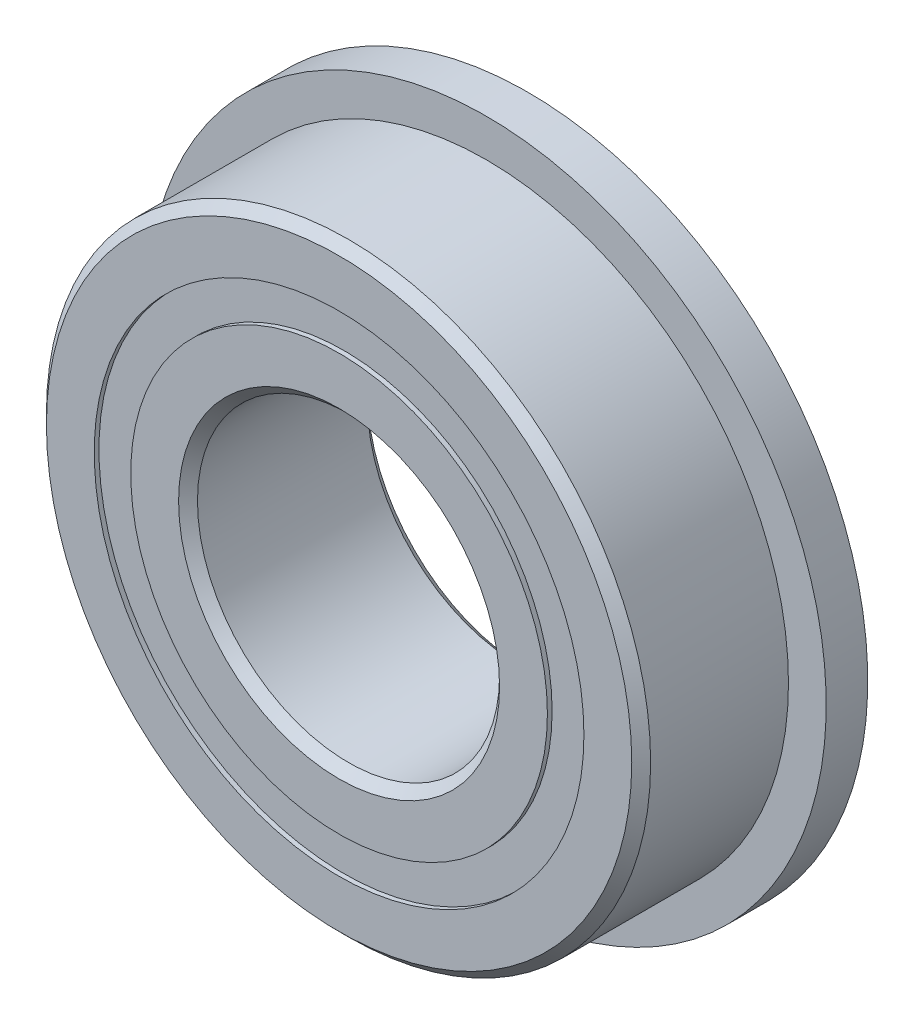
ISO-10303-21;
HEADER;
FILE_DESCRIPTION(('STEP AP214'),'2;1');
FILE_NAME('part.step','',(''),(''),'','','');
FILE_SCHEMA(('AUTOMOTIVE_DESIGN { 1 0 10303 214 1 1 1 1 }'));
ENDSEC;
DATA;
#1=APPLICATION_CONTEXT('core data for automotive mechanical design processes');
#2=APPLICATION_PROTOCOL_DEFINITION('international standard','automotive_design',2000,#1);
#3=PRODUCT_CONTEXT('',#1,'mechanical');
#4=PRODUCT('Part','Part','',(#3));
#5=PRODUCT_RELATED_PRODUCT_CATEGORY('part','',(#4));
#6=PRODUCT_DEFINITION_FORMATION('','',#4);
#7=PRODUCT_DEFINITION_CONTEXT('part definition',#1,'design');
#8=PRODUCT_DEFINITION('design','',#6,#7);
#9=PRODUCT_DEFINITION_SHAPE('','',#8);
#10=(LENGTH_UNIT() NAMED_UNIT(*) SI_UNIT(.MILLI.,.METRE.));
#11=(NAMED_UNIT(*) PLANE_ANGLE_UNIT() SI_UNIT($,.RADIAN.));
#12=(NAMED_UNIT(*) SI_UNIT($,.STERADIAN.) SOLID_ANGLE_UNIT());
#13=UNCERTAINTY_MEASURE_WITH_UNIT(LENGTH_MEASURE(1.E-05),#10,'distance_accuracy_value','');
#14=(GEOMETRIC_REPRESENTATION_CONTEXT(3) GLOBAL_UNCERTAINTY_ASSIGNED_CONTEXT((#13)) GLOBAL_UNIT_ASSIGNED_CONTEXT((#10,
#11,#12)) REPRESENTATION_CONTEXT('',''));
#15=CARTESIAN_POINT('',(0.,0.,0.));
#16=DIRECTION('',(0.,0.,1.));
#17=DIRECTION('',(1.,0.,0.));
#18=AXIS2_PLACEMENT_3D('',#15,#16,#17);
#19=CARTESIAN_POINT('',(0.,6.48351648351648,-2.375));
#20=DIRECTION('',(0.,0.,1.));
#21=DIRECTION('',(1.,0.,0.));
#22=AXIS2_PLACEMENT_3D('',#19,#20,#21);
#23=PLANE('',#22);
#24=CARTESIAN_POINT('',(0.,0.,-2.375));
#25=DIRECTION('',(0.,0.,1.));
#26=DIRECTION('',(1.,0.,0.));
#27=AXIS2_PLACEMENT_3D('',#24,#25,#26);
#28=CIRCLE('',#27,6.48351648351648);
#29=CARTESIAN_POINT('',(6.48351648351648,0.,-2.375));
#30=VERTEX_POINT('',#29);
#31=EDGE_CURVE('E60',#30,#30,#28,.T.);
#32=ORIENTED_EDGE('',*,*,#31,.F.);
#33=EDGE_LOOP('',(#32));
#34=FACE_BOUND('',#33,.T.);
#35=CARTESIAN_POINT('',(0.,0.,-2.375));
#36=DIRECTION('',(0.,0.,1.));
#37=DIRECTION('',(1.,0.,0.));
#38=AXIS2_PLACEMENT_3D('',#35,#36,#37);
#39=CIRCLE('',#38,5.51648351648352);
#40=CARTESIAN_POINT('',(5.51648351648352,0.,-2.375));
#41=VERTEX_POINT('',#40);
#42=EDGE_CURVE('E11',#41,#41,#39,.T.);
#43=ORIENTED_EDGE('',*,*,#42,.T.);
#44=EDGE_LOOP('',(#43));
#45=FACE_BOUND('',#44,.T.);
#46=ADVANCED_FACE('F46',(#34,#45),#23,.F.);
#47=CARTESIAN_POINT('',(0.,0.,2.5));
#48=DIRECTION('',(0.,0.,1.));
#49=DIRECTION('',(1.,0.,0.));
#50=AXIS2_PLACEMENT_3D('',#47,#48,#49);
#51=CYLINDRICAL_SURFACE('',#50,5.51648351648352);
#52=ORIENTED_EDGE('',*,*,#42,.F.);
#53=EDGE_LOOP('',(#52));
#54=FACE_BOUND('',#53,.T.);
#55=CARTESIAN_POINT('',(0.,0.,-1.21175743903915));
#56=DIRECTION('',(0.,0.,1.));
#57=DIRECTION('',(1.,0.,0.));
#58=AXIS2_PLACEMENT_3D('',#55,#56,#57);
#59=CIRCLE('',#58,5.51648351648352);
#60=CARTESIAN_POINT('',(5.51648351648352,0.,-1.21175743903915));
#61=VERTEX_POINT('',#60);
#62=EDGE_CURVE('E52',#61,#61,#59,.T.);
#63=ORIENTED_EDGE('',*,*,#62,.T.);
#64=EDGE_LOOP('',(#63));
#65=FACE_BOUND('',#64,.T.);
#66=ADVANCED_FACE('F69',(#54,#65),#51,.F.);
#67=CARTESIAN_POINT('',(0.,6.48351648351648,-1.21175743903915));
#68=DIRECTION('',(0.,0.,-1.));
#69=DIRECTION('',(-1.,0.,0.));
#70=AXIS2_PLACEMENT_3D('',#67,#68,#69);
#71=PLANE('',#70);
#72=ORIENTED_EDGE('',*,*,#62,.F.);
#73=EDGE_LOOP('',(#72));
#74=FACE_BOUND('',#73,.T.);
#75=CARTESIAN_POINT('',(0.,0.,-1.21175743903915));
#76=DIRECTION('',(0.,0.,1.));
#77=DIRECTION('',(1.,0.,0.));
#78=AXIS2_PLACEMENT_3D('',#75,#76,#77);
#79=CIRCLE('',#78,6.48351648351648);
#80=CARTESIAN_POINT('',(6.48351648351648,0.,-1.21175743903915));
#81=VERTEX_POINT('',#80);
#82=EDGE_CURVE('E56',#81,#81,#79,.T.);
#83=ORIENTED_EDGE('',*,*,#82,.T.);
#84=EDGE_LOOP('',(#83));
#85=FACE_BOUND('',#84,.T.);
#86=ADVANCED_FACE('F73',(#74,#85),#71,.F.);
#87=CARTESIAN_POINT('',(0.,0.,2.5));
#88=DIRECTION('',(0.,0.,1.));
#89=DIRECTION('',(1.,0.,0.));
#90=AXIS2_PLACEMENT_3D('',#87,#88,#89);
#91=CYLINDRICAL_SURFACE('',#90,6.48351648351648);
#92=ORIENTED_EDGE('',*,*,#82,.F.);
#93=EDGE_LOOP('',(#92));
#94=FACE_BOUND('',#93,.T.);
#95=ORIENTED_EDGE('',*,*,#31,.T.);
#96=EDGE_LOOP('',(#95));
#97=FACE_BOUND('',#96,.T.);
#98=ADVANCED_FACE('F66',(#94,#97),#91,.T.);
#99=CLOSED_SHELL('',(#46,#66,#86,#98));
#100=MANIFOLD_SOLID_BREP('B2',#99);
#101=CARTESIAN_POINT('',(0.,6.48351648351648,2.375));
#102=DIRECTION('',(0.,0.,-1.));
#103=DIRECTION('',(-1.,0.,0.));
#104=AXIS2_PLACEMENT_3D('',#101,#102,#103);
#105=PLANE('',#104);
#106=CARTESIAN_POINT('',(0.,0.,2.375));
#107=DIRECTION('',(0.,0.,1.));
#108=DIRECTION('',(1.,0.,0.));
#109=AXIS2_PLACEMENT_3D('',#106,#107,#108);
#110=CIRCLE('',#109,5.51648351648352);
#111=CARTESIAN_POINT('',(5.51648351648352,0.,2.375));
#112=VERTEX_POINT('',#111);
#113=EDGE_CURVE('E45',#112,#112,#110,.T.);
#114=ORIENTED_EDGE('',*,*,#113,.F.);
#115=EDGE_LOOP('',(#114));
#116=FACE_BOUND('',#115,.T.);
#117=CARTESIAN_POINT('',(0.,0.,2.375));
#118=DIRECTION('',(0.,0.,1.));
#119=DIRECTION('',(1.,0.,0.));
#120=AXIS2_PLACEMENT_3D('',#117,#118,#119);
#121=CIRCLE('',#120,6.48351648351648);
#122=CARTESIAN_POINT('',(6.48351648351648,0.,2.375));
#123=VERTEX_POINT('',#122);
#124=EDGE_CURVE('E128',#123,#123,#121,.T.);
#125=ORIENTED_EDGE('',*,*,#124,.T.);
#126=EDGE_LOOP('',(#125));
#127=FACE_BOUND('',#126,.T.);
#128=ADVANCED_FACE('F114',(#116,#127),#105,.F.);
#129=CARTESIAN_POINT('',(0.,0.,2.5));
#130=DIRECTION('',(0.,0.,1.));
#131=DIRECTION('',(1.,0.,0.));
#132=AXIS2_PLACEMENT_3D('',#129,#130,#131);
#133=CYLINDRICAL_SURFACE('',#132,5.51648351648352);
#134=CARTESIAN_POINT('',(0.,0.,1.21175743903915));
#135=DIRECTION('',(0.,0.,1.));
#136=DIRECTION('',(1.,0.,0.));
#137=AXIS2_PLACEMENT_3D('',#134,#135,#136);
#138=CIRCLE('',#137,5.51648351648352);
#139=CARTESIAN_POINT('',(5.51648351648352,0.,1.21175743903915));
#140=VERTEX_POINT('',#139);
#141=EDGE_CURVE('E120',#140,#140,#138,.T.);
#142=ORIENTED_EDGE('',*,*,#141,.F.);
#143=EDGE_LOOP('',(#142));
#144=FACE_BOUND('',#143,.T.);
#145=ORIENTED_EDGE('',*,*,#113,.T.);
#146=EDGE_LOOP('',(#145));
#147=FACE_BOUND('',#146,.T.);
#148=ADVANCED_FACE('F143',(#144,#147),#133,.F.);
#149=CARTESIAN_POINT('',(0.,6.48351648351648,1.21175743903915));
#150=DIRECTION('',(0.,0.,1.));
#151=DIRECTION('',(1.,0.,0.));
#152=AXIS2_PLACEMENT_3D('',#149,#150,#151);
#153=PLANE('',#152);
#154=CARTESIAN_POINT('',(0.,0.,1.21175743903915));
#155=DIRECTION('',(0.,0.,1.));
#156=DIRECTION('',(1.,0.,0.));
#157=AXIS2_PLACEMENT_3D('',#154,#155,#156);
#158=CIRCLE('',#157,6.48351648351648);
#159=CARTESIAN_POINT('',(6.48351648351648,0.,1.21175743903915));
#160=VERTEX_POINT('',#159);
#161=EDGE_CURVE('E124',#160,#160,#158,.T.);
#162=ORIENTED_EDGE('',*,*,#161,.F.);
#163=EDGE_LOOP('',(#162));
#164=FACE_BOUND('',#163,.T.);
#165=ORIENTED_EDGE('',*,*,#141,.T.);
#166=EDGE_LOOP('',(#165));
#167=FACE_BOUND('',#166,.T.);
#168=ADVANCED_FACE('F138',(#164,#167),#153,.F.);
#169=CARTESIAN_POINT('',(0.,0.,2.5));
#170=DIRECTION('',(0.,0.,1.));
#171=DIRECTION('',(1.,0.,0.));
#172=AXIS2_PLACEMENT_3D('',#169,#170,#171);
#173=CYLINDRICAL_SURFACE('',#172,6.48351648351648);
#174=ORIENTED_EDGE('',*,*,#124,.F.);
#175=EDGE_LOOP('',(#174));
#176=FACE_BOUND('',#175,.T.);
#177=ORIENTED_EDGE('',*,*,#161,.T.);
#178=EDGE_LOOP('',(#177));
#179=FACE_BOUND('',#178,.T.);
#180=ADVANCED_FACE('F135',(#176,#179),#173,.T.);
#181=CLOSED_SHELL('',(#128,#148,#168,#180));
#182=MANIFOLD_SOLID_BREP('B6',#181);
#183=CARTESIAN_POINT('',(-2.99999999999993,5.19615242270667,0.));
#184=DIRECTION('',(0.,0.,1.));
#185=DIRECTION('',(-0.499999999999989,0.866025403784445,0.));
#186=AXIS2_PLACEMENT_3D('',#183,#184,#185);
#187=SPHERICAL_SURFACE('',#186,1.21175743903915);
#188=CARTESIAN_POINT('',(-2.99999999999993,5.19615242270667,1.21175743903915));
#189=VERTEX_POINT('',#188);
#190=VERTEX_LOOP('',#189);
#191=FACE_BOUND('',#190,.T.);
#192=ADVANCED_FACE('F182',(#191),#187,.T.);
#193=CLOSED_SHELL('',(#192));
#194=MANIFOLD_SOLID_BREP('B40',#193);
#195=CARTESIAN_POINT('',(-5.1961524227066,3.00000000000006,0.));
#196=DIRECTION('',(0.,0.,1.));
#197=DIRECTION('',(-0.866025403784433,0.50000000000001,0.));
#198=AXIS2_PLACEMENT_3D('',#195,#196,#197);
#199=SPHERICAL_SURFACE('',#198,1.21175743903915);
#200=CARTESIAN_POINT('',(-5.1961524227066,3.00000000000006,1.21175743903915));
#201=VERTEX_POINT('',#200);
#202=VERTEX_LOOP('',#201);
#203=FACE_BOUND('',#202,.T.);
#204=ADVANCED_FACE('F203',(#203),#199,.T.);
#205=CLOSED_SHELL('',(#204));
#206=MANIFOLD_SOLID_BREP('B110',#205);
#207=CARTESIAN_POINT('',(-6.,0.,0.));
#208=DIRECTION('',(0.,0.,1.));
#209=DIRECTION('',(-1.,0.,0.));
#210=AXIS2_PLACEMENT_3D('',#207,#208,#209);
#211=SPHERICAL_SURFACE('',#210,1.21175743903915);
#212=CARTESIAN_POINT('',(-6.,0.,1.21175743903915));
#213=VERTEX_POINT('',#212);
#214=VERTEX_LOOP('',#213);
#215=FACE_BOUND('',#214,.T.);
#216=ADVANCED_FACE('F224',(#215),#211,.T.);
#217=CLOSED_SHELL('',(#216));
#218=MANIFOLD_SOLID_BREP('B178',#217);
#219=CARTESIAN_POINT('',(-5.19615242270666,-2.99999999999995,0.));
#220=DIRECTION('',(0.,0.,1.));
#221=DIRECTION('',(-0.866025403784443,-0.499999999999992,0.));
#222=AXIS2_PLACEMENT_3D('',#219,#220,#221);
#223=SPHERICAL_SURFACE('',#222,1.21175743903915);
#224=CARTESIAN_POINT('',(-5.19615242270666,-2.99999999999995,1.21175743903915));
#225=VERTEX_POINT('',#224);
#226=VERTEX_LOOP('',#225);
#227=FACE_BOUND('',#226,.T.);
#228=ADVANCED_FACE('F245',(#227),#223,.T.);
#229=CLOSED_SHELL('',(#228));
#230=MANIFOLD_SOLID_BREP('B199',#229);
#231=CARTESIAN_POINT('',(-3.00000000000004,-5.19615242270661,0.));
#232=DIRECTION('',(0.,0.,1.));
#233=DIRECTION('',(-0.500000000000007,-0.866025403784435,0.));
#234=AXIS2_PLACEMENT_3D('',#231,#232,#233);
#235=SPHERICAL_SURFACE('',#234,1.21175743903915);
#236=CARTESIAN_POINT('',(-3.00000000000004,-5.19615242270661,1.21175743903915));
#237=VERTEX_POINT('',#236);
#238=VERTEX_LOOP('',#237);
#239=FACE_BOUND('',#238,.T.);
#240=ADVANCED_FACE('F266',(#239),#235,.T.);
#241=CLOSED_SHELL('',(#240));
#242=MANIFOLD_SOLID_BREP('B220',#241);
#243=CARTESIAN_POINT('',(0.,-6.,0.));
#244=DIRECTION('',(0.,0.,1.));
#245=DIRECTION('',(0.,-1.,0.));
#246=AXIS2_PLACEMENT_3D('',#243,#244,#245);
#247=SPHERICAL_SURFACE('',#246,1.21175743903915);
#248=CARTESIAN_POINT('',(0.,-6.,1.21175743903915));
#249=VERTEX_POINT('',#248);
#250=VERTEX_LOOP('',#249);
#251=FACE_BOUND('',#250,.T.);
#252=ADVANCED_FACE('F287',(#251),#247,.T.);
#253=CLOSED_SHELL('',(#252));
#254=MANIFOLD_SOLID_BREP('B241',#253);
#255=CARTESIAN_POINT('',(2.99999999999997,-5.19615242270665,0.));
#256=DIRECTION('',(0.,0.,1.));
#257=DIRECTION('',(0.499999999999995,-0.866025403784442,0.));
#258=AXIS2_PLACEMENT_3D('',#255,#256,#257);
#259=SPHERICAL_SURFACE('',#258,1.21175743903915);
#260=CARTESIAN_POINT('',(2.99999999999997,-5.19615242270665,1.21175743903915));
#261=VERTEX_POINT('',#260);
#262=VERTEX_LOOP('',#261);
#263=FACE_BOUND('',#262,.T.);
#264=ADVANCED_FACE('F308',(#263),#259,.T.);
#265=CLOSED_SHELL('',(#264));
#266=MANIFOLD_SOLID_BREP('B262',#265);
#267=CARTESIAN_POINT('',(5.19615242270662,-3.00000000000002,0.));
#268=DIRECTION('',(0.,0.,1.));
#269=DIRECTION('',(0.866025403784436,-0.500000000000004,0.));
#270=AXIS2_PLACEMENT_3D('',#267,#268,#269);
#271=SPHERICAL_SURFACE('',#270,1.21175743903915);
#272=CARTESIAN_POINT('',(5.19615242270662,-3.00000000000002,1.21175743903915));
#273=VERTEX_POINT('',#272);
#274=VERTEX_LOOP('',#273);
#275=FACE_BOUND('',#274,.T.);
#276=ADVANCED_FACE('F329',(#275),#271,.T.);
#277=CLOSED_SHELL('',(#276));
#278=MANIFOLD_SOLID_BREP('B283',#277);
#279=CARTESIAN_POINT('',(6.,0.,0.));
#280=DIRECTION('',(0.,0.,1.));
#281=DIRECTION('',(1.,0.,0.));
#282=AXIS2_PLACEMENT_3D('',#279,#280,#281);
#283=SPHERICAL_SURFACE('',#282,1.21175743903915);
#284=CARTESIAN_POINT('',(6.,0.,1.21175743903915));
#285=VERTEX_POINT('',#284);
#286=VERTEX_LOOP('',#285);
#287=FACE_BOUND('',#286,.T.);
#288=ADVANCED_FACE('F350',(#287),#283,.T.);
#289=CLOSED_SHELL('',(#288));
#290=MANIFOLD_SOLID_BREP('B304',#289);
#291=CARTESIAN_POINT('',(5.19615242270664,2.99999999999999,0.));
#292=DIRECTION('',(0.,0.,1.));
#293=DIRECTION('',(0.86602540378444,0.499999999999998,0.));
#294=AXIS2_PLACEMENT_3D('',#291,#292,#293);
#295=SPHERICAL_SURFACE('',#294,1.21175743903915);
#296=CARTESIAN_POINT('',(5.19615242270664,2.99999999999999,1.21175743903915));
#297=VERTEX_POINT('',#296);
#298=VERTEX_LOOP('',#297);
#299=FACE_BOUND('',#298,.T.);
#300=ADVANCED_FACE('F371',(#299),#295,.T.);
#301=CLOSED_SHELL('',(#300));
#302=MANIFOLD_SOLID_BREP('B325',#301);
#303=CARTESIAN_POINT('',(3.00000000000001,5.19615242270663,0.));
#304=DIRECTION('',(0.,0.,1.));
#305=DIRECTION('',(0.500000000000001,0.866025403784438,0.));
#306=AXIS2_PLACEMENT_3D('',#303,#304,#305);
#307=SPHERICAL_SURFACE('',#306,1.21175743903915);
#308=CARTESIAN_POINT('',(3.00000000000001,5.19615242270663,1.21175743903915));
#309=VERTEX_POINT('',#308);
#310=VERTEX_LOOP('',#309);
#311=FACE_BOUND('',#310,.T.);
#312=ADVANCED_FACE('F392',(#311),#307,.T.);
#313=CLOSED_SHELL('',(#312));
#314=MANIFOLD_SOLID_BREP('B346',#313);
#315=CARTESIAN_POINT('',(0.,6.,0.));
#316=DIRECTION('',(0.,0.,1.));
#317=DIRECTION('',(0.,1.,0.));
#318=AXIS2_PLACEMENT_3D('',#315,#316,#317);
#319=SPHERICAL_SURFACE('',#318,1.21175743903915);
#320=CARTESIAN_POINT('',(0.,6.,1.21175743903915));
#321=VERTEX_POINT('',#320);
#322=VERTEX_LOOP('',#321);
#323=FACE_BOUND('',#322,.T.);
#324=ADVANCED_FACE('F415',(#323),#319,.T.);
#325=CLOSED_SHELL('',(#324));
#326=MANIFOLD_SOLID_BREP('B367',#325);
#327=CARTESIAN_POINT('',(0.,5.51648351648352,2.5));
#328=DIRECTION('',(0.,0.,-1.));
#329=DIRECTION('',(-1.,0.,0.));
#330=AXIS2_PLACEMENT_3D('',#327,#328,#329);
#331=PLANE('',#330);
#332=CARTESIAN_POINT('',(0.,0.,2.5));
#333=DIRECTION('',(0.,0.,1.));
#334=DIRECTION('',(1.,0.,0.));
#335=AXIS2_PLACEMENT_3D('',#332,#333,#334);
#336=CIRCLE('',#335,4.25);
#337=CARTESIAN_POINT('',(4.25,0.,2.5));
#338=VERTEX_POINT('',#337);
#339=EDGE_CURVE('E463',#338,#338,#336,.T.);
#340=ORIENTED_EDGE('',*,*,#339,.F.);
#341=EDGE_LOOP('',(#340));
#342=FACE_BOUND('',#341,.T.);
#343=CARTESIAN_POINT('',(0.,0.,2.5));
#344=DIRECTION('',(0.,0.,1.));
#345=DIRECTION('',(1.,0.,0.));
#346=AXIS2_PLACEMENT_3D('',#343,#344,#345);
#347=CIRCLE('',#346,5.51648351648352);
#348=CARTESIAN_POINT('',(5.51648351648352,0.,2.5));
#349=VERTEX_POINT('',#348);
#350=EDGE_CURVE('E414',#349,#349,#347,.T.);
#351=ORIENTED_EDGE('',*,*,#350,.T.);
#352=EDGE_LOOP('',(#351));
#353=FACE_BOUND('',#352,.T.);
#354=ADVANCED_FACE('F435',(#342,#353),#331,.F.);
#355=CARTESIAN_POINT('',(0.,0.,2.5));
#356=DIRECTION('',(0.,0.,1.));
#357=DIRECTION('',(1.,0.,0.));
#358=AXIS2_PLACEMENT_3D('',#355,#356,#357);
#359=CYLINDRICAL_SURFACE('',#358,5.51648351648352);
#360=ORIENTED_EDGE('',*,*,#350,.F.);
#361=EDGE_LOOP('',(#360));
#362=FACE_BOUND('',#361,.T.);
#363=CARTESIAN_POINT('',(0.,0.,1.11111111111111));
#364=DIRECTION('',(0.,0.,1.));
#365=DIRECTION('',(1.,0.,0.));
#366=AXIS2_PLACEMENT_3D('',#363,#364,#365);
#367=CIRCLE('',#366,5.51648351648352);
#368=CARTESIAN_POINT('',(5.51648351648352,0.,1.11111111111111));
#369=VERTEX_POINT('',#368);
#370=EDGE_CURVE('E441',#369,#369,#367,.T.);
#371=ORIENTED_EDGE('',*,*,#370,.T.);
#372=EDGE_LOOP('',(#371));
#373=FACE_BOUND('',#372,.T.);
#374=ADVANCED_FACE('F470',(#362,#373),#359,.T.);
#375=CARTESIAN_POINT('',(0.,0.,0.));
#376=DIRECTION('',(0.,0.,1.));
#377=DIRECTION('',(1.,0.,0.));
#378=AXIS2_PLACEMENT_3D('',#375,#376,#377);
#379=TOROIDAL_SURFACE('',#378,6.,1.21175743903915);
#380=ORIENTED_EDGE('',*,*,#370,.F.);
#381=EDGE_LOOP('',(#380));
#382=FACE_BOUND('',#381,.T.);
#383=CARTESIAN_POINT('',(0.,0.,-1.11111111111111));
#384=DIRECTION('',(0.,0.,1.));
#385=DIRECTION('',(1.,0.,0.));
#386=AXIS2_PLACEMENT_3D('',#383,#384,#385);
#387=CIRCLE('',#386,5.51648351648352);
#388=CARTESIAN_POINT('',(5.51648351648352,0.,-1.11111111111111));
#389=VERTEX_POINT('',#388);
#390=EDGE_CURVE('E445',#389,#389,#387,.T.);
#391=ORIENTED_EDGE('',*,*,#390,.T.);
#392=EDGE_LOOP('',(#391));
#393=FACE_BOUND('',#392,.T.);
#394=ADVANCED_FACE('F474',(#382,#393),#379,.F.);
#395=CARTESIAN_POINT('',(0.,0.,2.5));
#396=DIRECTION('',(0.,0.,1.));
#397=DIRECTION('',(1.,0.,0.));
#398=AXIS2_PLACEMENT_3D('',#395,#396,#397);
#399=CYLINDRICAL_SURFACE('',#398,5.51648351648352);
#400=ORIENTED_EDGE('',*,*,#390,.F.);
#401=EDGE_LOOP('',(#400));
#402=FACE_BOUND('',#401,.T.);
#403=CARTESIAN_POINT('',(0.,0.,-2.5));
#404=DIRECTION('',(0.,0.,1.));
#405=DIRECTION('',(1.,0.,0.));
#406=AXIS2_PLACEMENT_3D('',#403,#404,#405);
#407=CIRCLE('',#406,5.51648351648352);
#408=CARTESIAN_POINT('',(5.51648351648352,0.,-2.5));
#409=VERTEX_POINT('',#408);
#410=EDGE_CURVE('E449',#409,#409,#407,.T.);
#411=ORIENTED_EDGE('',*,*,#410,.T.);
#412=EDGE_LOOP('',(#411));
#413=FACE_BOUND('',#412,.T.);
#414=ADVANCED_FACE('F479',(#402,#413),#399,.T.);
#415=CARTESIAN_POINT('',(0.,4.25,-2.5));
#416=DIRECTION('',(0.,0.,1.));
#417=DIRECTION('',(1.,0.,0.));
#418=AXIS2_PLACEMENT_3D('',#415,#416,#417);
#419=PLANE('',#418);
#420=ORIENTED_EDGE('',*,*,#410,.F.);
#421=EDGE_LOOP('',(#420));
#422=FACE_BOUND('',#421,.T.);
#423=CARTESIAN_POINT('',(0.,0.,-2.5));
#424=DIRECTION('',(0.,0.,1.));
#425=DIRECTION('',(1.,0.,0.));
#426=AXIS2_PLACEMENT_3D('',#423,#424,#425);
#427=CIRCLE('',#426,4.25);
#428=CARTESIAN_POINT('',(4.25,0.,-2.5));
#429=VERTEX_POINT('',#428);
#430=EDGE_CURVE('E454',#429,#429,#427,.T.);
#431=ORIENTED_EDGE('',*,*,#430,.T.);
#432=EDGE_LOOP('',(#431));
#433=FACE_BOUND('',#432,.T.);
#434=ADVANCED_FACE('F485',(#422,#433),#419,.F.);
#435=CARTESIAN_POINT('',(0.,0.,-2.25));
#436=DIRECTION('',(0.,0.,-1.));
#437=DIRECTION('',(-1.,0.,0.));
#438=AXIS2_PLACEMENT_3D('',#435,#436,#437);
#439=CONICAL_SURFACE('',#438,4.,0.785398163397443);
#440=ORIENTED_EDGE('',*,*,#430,.F.);
#441=EDGE_LOOP('',(#440));
#442=FACE_BOUND('',#441,.T.);
#443=CARTESIAN_POINT('',(0.,0.,-2.25));
#444=DIRECTION('',(0.,0.,1.));
#445=DIRECTION('',(1.,0.,0.));
#446=AXIS2_PLACEMENT_3D('',#443,#444,#445);
#447=CIRCLE('',#446,4.);
#448=CARTESIAN_POINT('',(4.,0.,-2.25));
#449=VERTEX_POINT('',#448);
#450=EDGE_CURVE('E457',#449,#449,#447,.T.);
#451=ORIENTED_EDGE('',*,*,#450,.T.);
#452=EDGE_LOOP('',(#451));
#453=FACE_BOUND('',#452,.T.);
#454=ADVANCED_FACE('F489',(#442,#453),#439,.F.);
#455=CARTESIAN_POINT('',(0.,0.,2.5));
#456=DIRECTION('',(0.,0.,1.));
#457=DIRECTION('',(1.,0.,0.));
#458=AXIS2_PLACEMENT_3D('',#455,#456,#457);
#459=CYLINDRICAL_SURFACE('',#458,4.);
#460=ORIENTED_EDGE('',*,*,#450,.F.);
#461=EDGE_LOOP('',(#460));
#462=FACE_BOUND('',#461,.T.);
#463=CARTESIAN_POINT('',(0.,0.,2.25));
#464=DIRECTION('',(0.,0.,1.));
#465=DIRECTION('',(1.,0.,0.));
#466=AXIS2_PLACEMENT_3D('',#463,#464,#465);
#467=CIRCLE('',#466,4.);
#468=CARTESIAN_POINT('',(4.,0.,2.25));
#469=VERTEX_POINT('',#468);
#470=EDGE_CURVE('E460',#469,#469,#467,.T.);
#471=ORIENTED_EDGE('',*,*,#470,.T.);
#472=EDGE_LOOP('',(#471));
#473=FACE_BOUND('',#472,.T.);
#474=ADVANCED_FACE('F493',(#462,#473),#459,.F.);
#475=CARTESIAN_POINT('',(0.,0.,2.5));
#476=DIRECTION('',(0.,0.,1.));
#477=DIRECTION('',(1.,0.,0.));
#478=AXIS2_PLACEMENT_3D('',#475,#476,#477);
#479=CONICAL_SURFACE('',#478,4.25,0.785398163397455);
#480=ORIENTED_EDGE('',*,*,#470,.F.);
#481=EDGE_LOOP('',(#480));
#482=FACE_BOUND('',#481,.T.);
#483=ORIENTED_EDGE('',*,*,#339,.T.);
#484=EDGE_LOOP('',(#483));
#485=FACE_BOUND('',#484,.T.);
#486=ADVANCED_FACE('F467',(#482,#485),#479,.F.);
#487=CLOSED_SHELL('',(#354,#374,#394,#414,#434,#454,#474,#486));
#488=MANIFOLD_SOLID_BREP('B388',#487);
#489=CARTESIAN_POINT('',(0.,0.,2.25));
#490=DIRECTION('',(0.,0.,-1.));
#491=DIRECTION('',(-1.,0.,0.));
#492=AXIS2_PLACEMENT_3D('',#489,#490,#491);
#493=CONICAL_SURFACE('',#492,8.,0.785398163397446);
#494=CARTESIAN_POINT('',(0.,0.,2.5));
#495=DIRECTION('',(0.,0.,1.));
#496=DIRECTION('',(1.,0.,0.));
#497=AXIS2_PLACEMENT_3D('',#494,#495,#496);
#498=CIRCLE('',#497,7.75);
#499=CARTESIAN_POINT('',(7.75,0.,2.5));
#500=VERTEX_POINT('',#499);
#501=EDGE_CURVE('E579',#500,#500,#498,.T.);
#502=ORIENTED_EDGE('',*,*,#501,.F.);
#503=EDGE_LOOP('',(#502));
#504=FACE_BOUND('',#503,.T.);
#505=CARTESIAN_POINT('',(0.,0.,2.25));
#506=DIRECTION('',(0.,0.,1.));
#507=DIRECTION('',(1.,0.,0.));
#508=AXIS2_PLACEMENT_3D('',#505,#506,#507);
#509=CIRCLE('',#508,8.);
#510=CARTESIAN_POINT('',(8.,0.,2.25));
#511=VERTEX_POINT('',#510);
#512=EDGE_CURVE('E434',#511,#511,#509,.T.);
#513=ORIENTED_EDGE('',*,*,#512,.T.);
#514=EDGE_LOOP('',(#513));
#515=FACE_BOUND('',#514,.T.);
#516=ADVANCED_FACE('F557',(#504,#515),#493,.T.);
#517=CARTESIAN_POINT('',(0.,0.,2.5));
#518=DIRECTION('',(0.,0.,1.));
#519=DIRECTION('',(1.,0.,0.));
#520=AXIS2_PLACEMENT_3D('',#517,#518,#519);
#521=CYLINDRICAL_SURFACE('',#520,8.);
#522=CARTESIAN_POINT('',(0.,0.,-1.4));
#523=DIRECTION('',(0.,0.,1.));
#524=DIRECTION('',(1.,0.,0.));
#525=AXIS2_PLACEMENT_3D('',#522,#523,#524);
#526=CIRCLE('',#525,8.);
#527=CARTESIAN_POINT('',(8.,0.,-1.4));
#528=VERTEX_POINT('',#527);
#529=EDGE_CURVE('E582',#528,#528,#526,.T.);
#530=ORIENTED_EDGE('',*,*,#529,.T.);
#531=EDGE_LOOP('',(#530));
#532=FACE_BOUND('',#531,.T.);
#533=ORIENTED_EDGE('',*,*,#512,.F.);
#534=EDGE_LOOP('',(#533));
#535=FACE_BOUND('',#534,.T.);
#536=ADVANCED_FACE('F602',(#532,#535),#521,.T.);
#537=CARTESIAN_POINT('',(0.,7.75,-2.5));
#538=DIRECTION('',(0.,0.,1.));
#539=DIRECTION('',(1.,0.,0.));
#540=AXIS2_PLACEMENT_3D('',#537,#538,#539);
#541=PLANE('',#540);
#542=CARTESIAN_POINT('',(0.,0.,-2.5));
#543=DIRECTION('',(0.,0.,1.));
#544=DIRECTION('',(1.,0.,0.));
#545=AXIS2_PLACEMENT_3D('',#542,#543,#544);
#546=CIRCLE('',#545,6.48351648351648);
#547=CARTESIAN_POINT('',(6.48351648351648,0.,-2.5));
#548=VERTEX_POINT('',#547);
#549=EDGE_CURVE('E563',#548,#548,#546,.T.);
#550=ORIENTED_EDGE('',*,*,#549,.T.);
#551=EDGE_LOOP('',(#550));
#552=FACE_BOUND('',#551,.T.);
#553=CARTESIAN_POINT('',(0.,0.,-2.5));
#554=DIRECTION('',(0.,0.,-1.));
#555=DIRECTION('',(-1.,0.,0.));
#556=AXIS2_PLACEMENT_3D('',#553,#554,#555);
#557=CIRCLE('',#556,9.);
#558=CARTESIAN_POINT('',(-9.,0.,-2.5));
#559=VERTEX_POINT('',#558);
#560=EDGE_CURVE('E585',#559,#559,#557,.T.);
#561=ORIENTED_EDGE('',*,*,#560,.T.);
#562=EDGE_LOOP('',(#561));
#563=FACE_BOUND('',#562,.T.);
#564=ADVANCED_FACE('F605',(#552,#563),#541,.F.);
#565=CARTESIAN_POINT('',(0.,0.,2.5));
#566=DIRECTION('',(0.,0.,1.));
#567=DIRECTION('',(1.,0.,0.));
#568=AXIS2_PLACEMENT_3D('',#565,#566,#567);
#569=CYLINDRICAL_SURFACE('',#568,6.48351648351648);
#570=CARTESIAN_POINT('',(0.,0.,-1.11111111111111));
#571=DIRECTION('',(0.,0.,1.));
#572=DIRECTION('',(1.,0.,0.));
#573=AXIS2_PLACEMENT_3D('',#570,#571,#572);
#574=CIRCLE('',#573,6.48351648351648);
#575=CARTESIAN_POINT('',(6.48351648351648,0.,-1.11111111111111));
#576=VERTEX_POINT('',#575);
#577=EDGE_CURVE('E567',#576,#576,#574,.T.);
#578=ORIENTED_EDGE('',*,*,#577,.T.);
#579=EDGE_LOOP('',(#578));
#580=FACE_BOUND('',#579,.T.);
#581=ORIENTED_EDGE('',*,*,#549,.F.);
#582=EDGE_LOOP('',(#581));
#583=FACE_BOUND('',#582,.T.);
#584=ADVANCED_FACE('F610',(#580,#583),#569,.F.);
#585=CARTESIAN_POINT('',(0.,0.,0.));
#586=DIRECTION('',(0.,0.,1.));
#587=DIRECTION('',(1.,0.,0.));
#588=AXIS2_PLACEMENT_3D('',#585,#586,#587);
#589=TOROIDAL_SURFACE('',#588,6.,1.21175743903915);
#590=ORIENTED_EDGE('',*,*,#577,.F.);
#591=EDGE_LOOP('',(#590));
#592=FACE_BOUND('',#591,.T.);
#593=CARTESIAN_POINT('',(0.,0.,1.11111111111111));
#594=DIRECTION('',(0.,0.,1.));
#595=DIRECTION('',(1.,0.,0.));
#596=AXIS2_PLACEMENT_3D('',#593,#594,#595);
#597=CIRCLE('',#596,6.48351648351648);
#598=CARTESIAN_POINT('',(6.48351648351648,0.,1.11111111111111));
#599=VERTEX_POINT('',#598);
#600=EDGE_CURVE('E571',#599,#599,#597,.T.);
#601=ORIENTED_EDGE('',*,*,#600,.T.);
#602=EDGE_LOOP('',(#601));
#603=FACE_BOUND('',#602,.T.);
#604=ADVANCED_FACE('F616',(#592,#603),#589,.F.);
#605=CARTESIAN_POINT('',(0.,0.,2.5));
#606=DIRECTION('',(0.,0.,1.));
#607=DIRECTION('',(1.,0.,0.));
#608=AXIS2_PLACEMENT_3D('',#605,#606,#607);
#609=CYLINDRICAL_SURFACE('',#608,6.48351648351648);
#610=ORIENTED_EDGE('',*,*,#600,.F.);
#611=EDGE_LOOP('',(#610));
#612=FACE_BOUND('',#611,.T.);
#613=CARTESIAN_POINT('',(0.,0.,2.5));
#614=DIRECTION('',(0.,0.,1.));
#615=DIRECTION('',(1.,0.,0.));
#616=AXIS2_PLACEMENT_3D('',#613,#614,#615);
#617=CIRCLE('',#616,6.48351648351648);
#618=CARTESIAN_POINT('',(6.48351648351648,0.,2.5));
#619=VERTEX_POINT('',#618);
#620=EDGE_CURVE('E576',#619,#619,#617,.T.);
#621=ORIENTED_EDGE('',*,*,#620,.T.);
#622=EDGE_LOOP('',(#621));
#623=FACE_BOUND('',#622,.T.);
#624=ADVANCED_FACE('F620',(#612,#623),#609,.F.);
#625=CARTESIAN_POINT('',(0.,7.75,2.5));
#626=DIRECTION('',(0.,0.,-1.));
#627=DIRECTION('',(-1.,0.,0.));
#628=AXIS2_PLACEMENT_3D('',#625,#626,#627);
#629=PLANE('',#628);
#630=ORIENTED_EDGE('',*,*,#620,.F.);
#631=EDGE_LOOP('',(#630));
#632=FACE_BOUND('',#631,.T.);
#633=ORIENTED_EDGE('',*,*,#501,.T.);
#634=EDGE_LOOP('',(#633));
#635=FACE_BOUND('',#634,.T.);
#636=ADVANCED_FACE('F598',(#632,#635),#629,.F.);
#637=CARTESIAN_POINT('',(0.,6.48351648351648,-1.4));
#638=DIRECTION('',(0.,0.,1.));
#639=DIRECTION('',(1.,0.,0.));
#640=AXIS2_PLACEMENT_3D('',#637,#638,#639);
#641=PLANE('',#640);
#642=CARTESIAN_POINT('',(0.,0.,-1.4));
#643=DIRECTION('',(0.,0.,-1.));
#644=DIRECTION('',(-1.,0.,0.));
#645=AXIS2_PLACEMENT_3D('',#642,#643,#644);
#646=CIRCLE('',#645,9.);
#647=CARTESIAN_POINT('',(-9.,0.,-1.4));
#648=VERTEX_POINT('',#647);
#649=EDGE_CURVE('E588',#648,#648,#646,.T.);
#650=ORIENTED_EDGE('',*,*,#649,.F.);
#651=EDGE_LOOP('',(#650));
#652=FACE_BOUND('',#651,.T.);
#653=ORIENTED_EDGE('',*,*,#529,.F.);
#654=EDGE_LOOP('',(#653));
#655=FACE_BOUND('',#654,.T.);
#656=ADVANCED_FACE('F595',(#652,#655),#641,.T.);
#657=CARTESIAN_POINT('',(0.,0.,-2.5));
#658=DIRECTION('',(0.,0.,-1.));
#659=DIRECTION('',(-1.,0.,0.));
#660=AXIS2_PLACEMENT_3D('',#657,#658,#659);
#661=CYLINDRICAL_SURFACE('',#660,9.);
#662=ORIENTED_EDGE('',*,*,#649,.T.);
#663=EDGE_LOOP('',(#662));
#664=FACE_BOUND('',#663,.T.);
#665=ORIENTED_EDGE('',*,*,#560,.F.);
#666=EDGE_LOOP('',(#665));
#667=FACE_BOUND('',#666,.T.);
#668=ADVANCED_FACE('F592',(#664,#667),#661,.T.);
#669=CLOSED_SHELL('',(#516,#536,#564,#584,#604,#624,#636,#656,#668));
#670=MANIFOLD_SOLID_BREP('B409',#669);
#671=ADVANCED_BREP_SHAPE_REPRESENTATION('',(#18,#100,#182,#194,#206,#218,#230,#242,#254,#266,
#278,#290,#302,#314,#326,#488,#670),#14);
#672=SHAPE_DEFINITION_REPRESENTATION(#9,#671);
ENDSEC;
END-ISO-10303-21;
